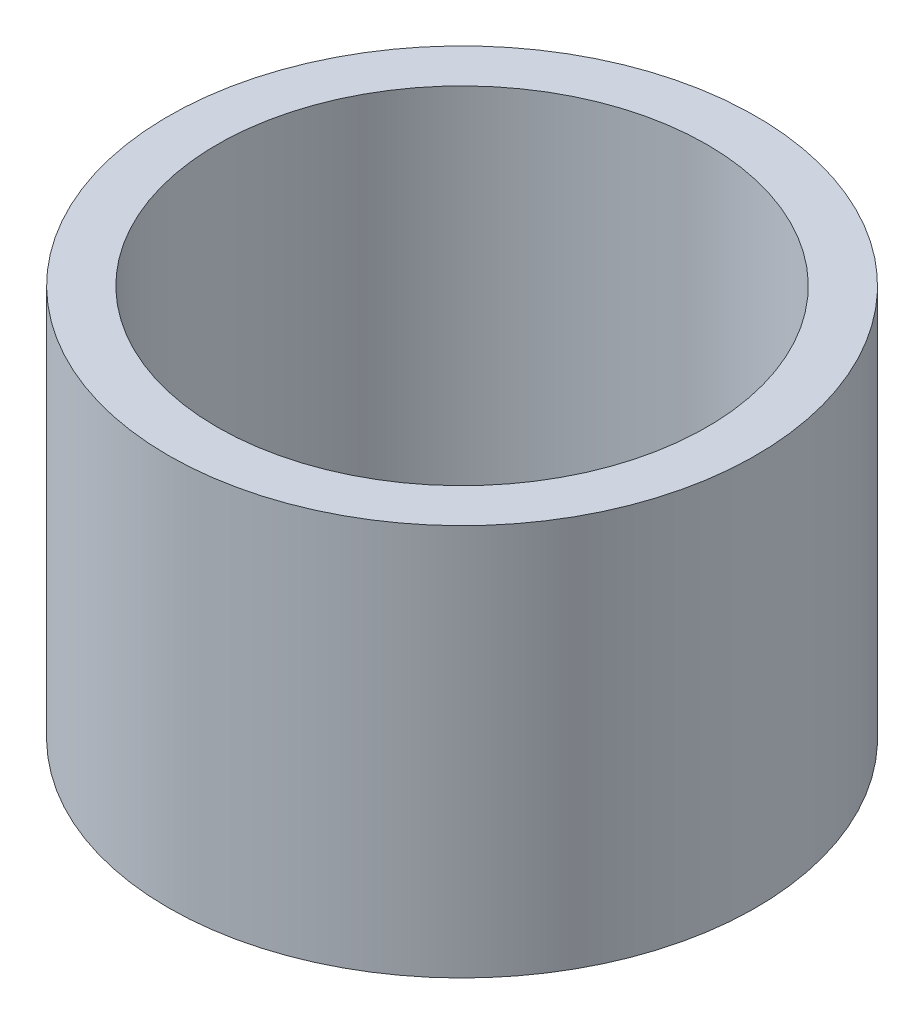
ISO-10303-21;
HEADER;
FILE_DESCRIPTION(('STEP AP214'),'2;1');
FILE_NAME('part.step','',(''),(''),'','','');
FILE_SCHEMA(('AUTOMOTIVE_DESIGN { 1 0 10303 214 1 1 1 1 }'));
ENDSEC;
DATA;
#1=APPLICATION_CONTEXT('core data for automotive mechanical design processes');
#2=APPLICATION_PROTOCOL_DEFINITION('international standard','automotive_design',2000,#1);
#3=PRODUCT_CONTEXT('',#1,'mechanical');
#4=PRODUCT('Part','Part','',(#3));
#5=PRODUCT_RELATED_PRODUCT_CATEGORY('part','',(#4));
#6=PRODUCT_DEFINITION_FORMATION('','',#4);
#7=PRODUCT_DEFINITION_CONTEXT('part definition',#1,'design');
#8=PRODUCT_DEFINITION('design','',#6,#7);
#9=PRODUCT_DEFINITION_SHAPE('','',#8);
#10=(LENGTH_UNIT() NAMED_UNIT(*) SI_UNIT(.MILLI.,.METRE.));
#11=(NAMED_UNIT(*) PLANE_ANGLE_UNIT() SI_UNIT($,.RADIAN.));
#12=(NAMED_UNIT(*) SI_UNIT($,.STERADIAN.) SOLID_ANGLE_UNIT());
#13=UNCERTAINTY_MEASURE_WITH_UNIT(LENGTH_MEASURE(1.E-05),#10,'distance_accuracy_value','');
#14=(GEOMETRIC_REPRESENTATION_CONTEXT(3) GLOBAL_UNCERTAINTY_ASSIGNED_CONTEXT((#13)) GLOBAL_UNIT_ASSIGNED_CONTEXT((#10,
#11,#12)) REPRESENTATION_CONTEXT('',''));
#15=CARTESIAN_POINT('',(0.,0.,0.));
#16=DIRECTION('',(0.,0.,1.));
#17=DIRECTION('',(1.,0.,0.));
#18=AXIS2_PLACEMENT_3D('',#15,#16,#17);
#19=CARTESIAN_POINT('',(0.,0.,0.));
#20=DIRECTION('',(0.,1.,0.));
#21=DIRECTION('',(0.,0.,1.));
#22=AXIS2_PLACEMENT_3D('',#19,#20,#21);
#23=PLANE('',#22);
#24=CARTESIAN_POINT('',(0.,0.,0.));
#25=DIRECTION('',(0.,1.,0.));
#26=DIRECTION('',(0.,0.,1.));
#27=AXIS2_PLACEMENT_3D('',#24,#25,#26);
#28=CIRCLE('',#27,50.);
#29=CARTESIAN_POINT('',(0.,0.,50.));
#30=VERTEX_POINT('',#29);
#31=EDGE_CURVE('E49',#30,#30,#28,.T.);
#32=ORIENTED_EDGE('',*,*,#31,.T.);
#33=EDGE_LOOP('',(#32));
#34=FACE_BOUND('',#33,.T.);
#35=CARTESIAN_POINT('',(0.,0.,0.));
#36=DIRECTION('',(0.,1.,0.));
#37=DIRECTION('',(0.,0.,1.));
#38=AXIS2_PLACEMENT_3D('',#35,#36,#37);
#39=CIRCLE('',#38,60.);
#40=CARTESIAN_POINT('',(0.,0.,60.));
#41=VERTEX_POINT('',#40);
#42=EDGE_CURVE('E10',#41,#41,#39,.T.);
#43=ORIENTED_EDGE('',*,*,#42,.F.);
#44=EDGE_LOOP('',(#43));
#45=FACE_BOUND('',#44,.T.);
#46=ADVANCED_FACE('F39',(#34,#45),#23,.F.);
#47=CARTESIAN_POINT('',(0.,80.,0.));
#48=DIRECTION('',(0.,1.,0.));
#49=DIRECTION('',(0.,0.,1.));
#50=AXIS2_PLACEMENT_3D('',#47,#48,#49);
#51=CYLINDRICAL_SURFACE('',#50,60.);
#52=CARTESIAN_POINT('',(0.,80.,0.));
#53=DIRECTION('',(0.,1.,0.));
#54=DIRECTION('',(0.,0.,1.));
#55=AXIS2_PLACEMENT_3D('',#52,#53,#54);
#56=CIRCLE('',#55,60.);
#57=CARTESIAN_POINT('',(0.,80.,60.));
#58=VERTEX_POINT('',#57);
#59=EDGE_CURVE('E45',#58,#58,#56,.T.);
#60=ORIENTED_EDGE('',*,*,#59,.F.);
#61=EDGE_LOOP('',(#60));
#62=FACE_BOUND('',#61,.T.);
#63=ORIENTED_EDGE('',*,*,#42,.T.);
#64=EDGE_LOOP('',(#63));
#65=FACE_BOUND('',#64,.T.);
#66=ADVANCED_FACE('F64',(#62,#65),#51,.T.);
#67=CARTESIAN_POINT('',(0.,80.,-60.));
#68=DIRECTION('',(0.,-1.,0.));
#69=DIRECTION('',(0.,0.,-1.));
#70=AXIS2_PLACEMENT_3D('',#67,#68,#69);
#71=PLANE('',#70);
#72=CARTESIAN_POINT('',(0.,80.,0.));
#73=DIRECTION('',(0.,1.,0.));
#74=DIRECTION('',(0.,0.,1.));
#75=AXIS2_PLACEMENT_3D('',#72,#73,#74);
#76=CIRCLE('',#75,50.);
#77=CARTESIAN_POINT('',(0.,80.,50.));
#78=VERTEX_POINT('',#77);
#79=EDGE_CURVE('E53',#78,#78,#76,.T.);
#80=ORIENTED_EDGE('',*,*,#79,.F.);
#81=EDGE_LOOP('',(#80));
#82=FACE_BOUND('',#81,.T.);
#83=ORIENTED_EDGE('',*,*,#59,.T.);
#84=EDGE_LOOP('',(#83));
#85=FACE_BOUND('',#84,.T.);
#86=ADVANCED_FACE('F62',(#82,#85),#71,.F.);
#87=CARTESIAN_POINT('',(0.,-20.,0.));
#88=DIRECTION('',(0.,1.,0.));
#89=DIRECTION('',(0.,0.,1.));
#90=AXIS2_PLACEMENT_3D('',#87,#88,#89);
#91=CYLINDRICAL_SURFACE('',#90,50.);
#92=ORIENTED_EDGE('',*,*,#79,.T.);
#93=EDGE_LOOP('',(#92));
#94=FACE_BOUND('',#93,.T.);
#95=ORIENTED_EDGE('',*,*,#31,.F.);
#96=EDGE_LOOP('',(#95));
#97=FACE_BOUND('',#96,.T.);
#98=ADVANCED_FACE('F59',(#94,#97),#91,.F.);
#99=CLOSED_SHELL('',(#46,#66,#86,#98));
#100=MANIFOLD_SOLID_BREP('B2',#99);
#101=ADVANCED_BREP_SHAPE_REPRESENTATION('',(#18,#100),#14);
#102=SHAPE_DEFINITION_REPRESENTATION(#9,#101);
ENDSEC;
END-ISO-10303-21;
